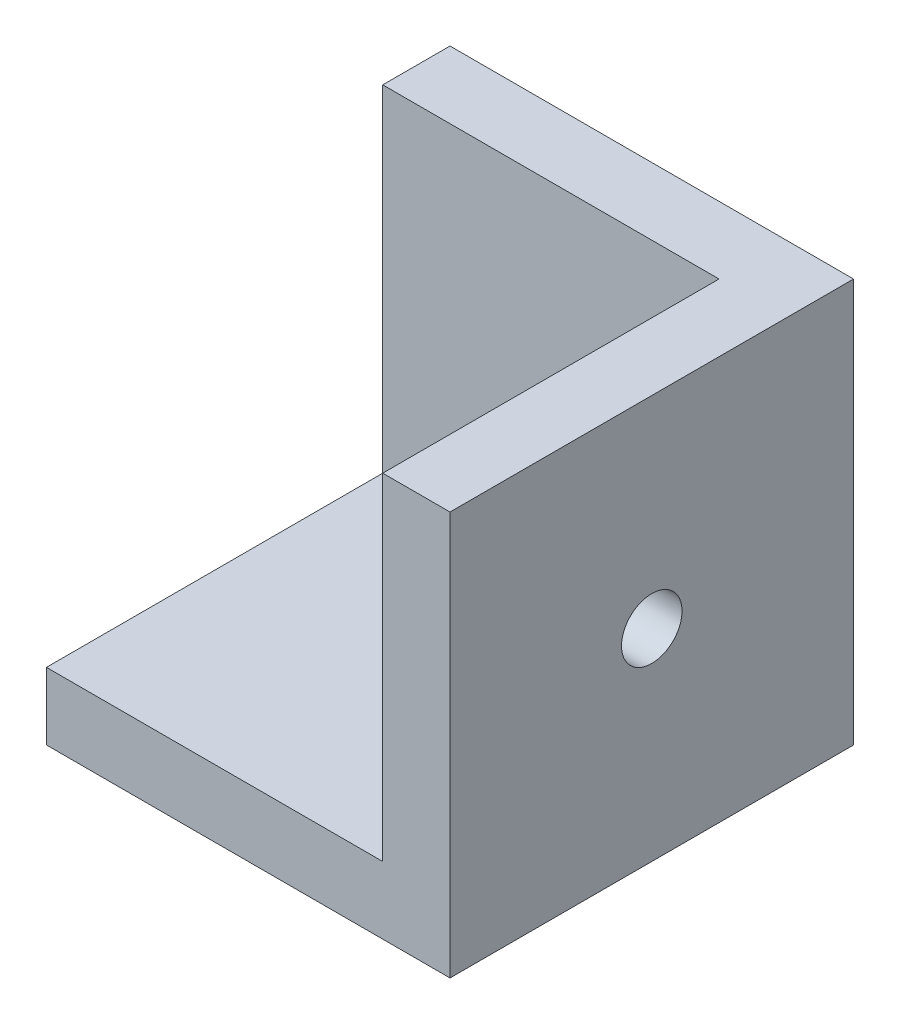
ISO-10303-21;
HEADER;
FILE_DESCRIPTION(('STEP AP214'),'2;1');
FILE_NAME('part.step','',(''),(''),'','','');
FILE_SCHEMA(('AUTOMOTIVE_DESIGN { 1 0 10303 214 1 1 1 1 }'));
ENDSEC;
DATA;
#1=APPLICATION_CONTEXT('core data for automotive mechanical design processes');
#2=APPLICATION_PROTOCOL_DEFINITION('international standard','automotive_design',2000,#1);
#3=PRODUCT_CONTEXT('',#1,'mechanical');
#4=PRODUCT('Part','Part','',(#3));
#5=PRODUCT_RELATED_PRODUCT_CATEGORY('part','',(#4));
#6=PRODUCT_DEFINITION_FORMATION('','',#4);
#7=PRODUCT_DEFINITION_CONTEXT('part definition',#1,'design');
#8=PRODUCT_DEFINITION('design','',#6,#7);
#9=PRODUCT_DEFINITION_SHAPE('','',#8);
#10=(LENGTH_UNIT() NAMED_UNIT(*) SI_UNIT(.MILLI.,.METRE.));
#11=(NAMED_UNIT(*) PLANE_ANGLE_UNIT() SI_UNIT($,.RADIAN.));
#12=(NAMED_UNIT(*) SI_UNIT($,.STERADIAN.) SOLID_ANGLE_UNIT());
#13=UNCERTAINTY_MEASURE_WITH_UNIT(LENGTH_MEASURE(1.E-05),#10,'distance_accuracy_value','');
#14=(GEOMETRIC_REPRESENTATION_CONTEXT(3) GLOBAL_UNCERTAINTY_ASSIGNED_CONTEXT((#13)) GLOBAL_UNIT_ASSIGNED_CONTEXT((#10,
#11,#12)) REPRESENTATION_CONTEXT('',''));
#15=CARTESIAN_POINT('',(0.,0.,0.));
#16=DIRECTION('',(0.,0.,1.));
#17=DIRECTION('',(1.,0.,0.));
#18=AXIS2_PLACEMENT_3D('',#15,#16,#17);
#19=CARTESIAN_POINT('',(0.,0.,30.));
#20=DIRECTION('',(-1.,0.,0.));
#21=DIRECTION('',(0.,0.,1.));
#22=AXIS2_PLACEMENT_3D('',#19,#20,#21);
#23=PLANE('',#22);
#24=CARTESIAN_POINT('',(0.,15.,15.));
#25=DIRECTION('',(-1.,0.,0.));
#26=DIRECTION('',(0.,0.,1.));
#27=AXIS2_PLACEMENT_3D('',#24,#25,#26);
#28=CIRCLE('',#27,2.25);
#29=CARTESIAN_POINT('',(0.,15.,17.25));
#30=VERTEX_POINT('',#29);
#31=EDGE_CURVE('E200',#30,#30,#28,.T.);
#32=ORIENTED_EDGE('',*,*,#31,.T.);
#33=EDGE_LOOP('',(#32));
#34=FACE_BOUND('',#33,.T.);
#35=DIRECTION('',(0.,1.,0.));
#36=VECTOR('',#35,1.);
#37=CARTESIAN_POINT('',(0.,0.,0.));
#38=LINE('',#37,#36);
#39=CARTESIAN_POINT('',(0.,0.,0.));
#40=VERTEX_POINT('',#39);
#41=CARTESIAN_POINT('',(0.,30.,0.));
#42=VERTEX_POINT('',#41);
#43=EDGE_CURVE('E148',#40,#42,#38,.T.);
#44=ORIENTED_EDGE('',*,*,#43,.T.);
#45=DIRECTION('',(0.,0.,-1.));
#46=VECTOR('',#45,1.);
#47=CARTESIAN_POINT('',(0.,30.,30.));
#48=LINE('',#47,#46);
#49=CARTESIAN_POINT('',(0.,30.,30.));
#50=VERTEX_POINT('',#49);
#51=EDGE_CURVE('E13',#50,#42,#48,.T.);
#52=ORIENTED_EDGE('',*,*,#51,.F.);
#53=DIRECTION('',(0.,1.,0.));
#54=VECTOR('',#53,1.);
#55=CARTESIAN_POINT('',(0.,0.,30.));
#56=LINE('',#55,#54);
#57=CARTESIAN_POINT('',(0.,0.,30.));
#58=VERTEX_POINT('',#57);
#59=EDGE_CURVE('E150',#58,#50,#56,.T.);
#60=ORIENTED_EDGE('',*,*,#59,.F.);
#61=DIRECTION('',(0.,0.,-1.));
#62=VECTOR('',#61,1.);
#63=CARTESIAN_POINT('',(0.,0.,30.));
#64=LINE('',#63,#62);
#65=EDGE_CURVE('E156',#58,#40,#64,.T.);
#66=ORIENTED_EDGE('',*,*,#65,.T.);
#67=EDGE_LOOP('',(#44,#52,#60,#66));
#68=FACE_BOUND('',#67,.T.);
#69=ADVANCED_FACE('F50',(#34,#68),#23,.F.);
#70=CARTESIAN_POINT('',(0.,30.,30.));
#71=DIRECTION('',(0.,-1.,0.));
#72=DIRECTION('',(1.,0.,0.));
#73=AXIS2_PLACEMENT_3D('',#70,#71,#72);
#74=PLANE('',#73);
#75=DIRECTION('',(-1.,0.,0.));
#76=VECTOR('',#75,1.);
#77=CARTESIAN_POINT('',(-5.,30.,5.));
#78=LINE('',#77,#76);
#79=CARTESIAN_POINT('',(-5.,30.,5.));
#80=VERTEX_POINT('',#79);
#81=CARTESIAN_POINT('',(-30.,30.,5.));
#82=VERTEX_POINT('',#81);
#83=EDGE_CURVE('E136',#80,#82,#78,.T.);
#84=ORIENTED_EDGE('',*,*,#83,.F.);
#85=DIRECTION('',(0.,0.,-1.));
#86=VECTOR('',#85,1.);
#87=CARTESIAN_POINT('',(-5.,30.,5.));
#88=LINE('',#87,#86);
#89=CARTESIAN_POINT('',(-5.,30.,30.));
#90=VERTEX_POINT('',#89);
#91=EDGE_CURVE('E124',#90,#80,#88,.T.);
#92=ORIENTED_EDGE('',*,*,#91,.F.);
#93=DIRECTION('',(-1.,0.,0.));
#94=VECTOR('',#93,1.);
#95=CARTESIAN_POINT('',(0.,30.,30.));
#96=LINE('',#95,#94);
#97=EDGE_CURVE('E99',#50,#90,#96,.T.);
#98=ORIENTED_EDGE('',*,*,#97,.F.);
#99=ORIENTED_EDGE('',*,*,#51,.T.);
#100=DIRECTION('',(-1.,0.,0.));
#101=VECTOR('',#100,1.);
#102=CARTESIAN_POINT('',(0.,30.,0.));
#103=LINE('',#102,#101);
#104=CARTESIAN_POINT('',(-30.,30.,0.));
#105=VERTEX_POINT('',#104);
#106=EDGE_CURVE('E159',#42,#105,#103,.T.);
#107=ORIENTED_EDGE('',*,*,#106,.T.);
#108=DIRECTION('',(0.,0.,-1.));
#109=VECTOR('',#108,1.);
#110=CARTESIAN_POINT('',(-30.,30.,30.));
#111=LINE('',#110,#109);
#112=EDGE_CURVE('E57',#82,#105,#111,.T.);
#113=ORIENTED_EDGE('',*,*,#112,.F.);
#114=EDGE_LOOP('',(#84,#92,#98,#99,#107,#113));
#115=FACE_BOUND('',#114,.T.);
#116=ADVANCED_FACE('F172',(#115),#74,.F.);
#117=CARTESIAN_POINT('',(-30.,0.,30.));
#118=DIRECTION('',(1.,0.,0.));
#119=DIRECTION('',(0.,0.,-1.));
#120=AXIS2_PLACEMENT_3D('',#117,#118,#119);
#121=PLANE('',#120);
#122=DIRECTION('',(0.,0.,1.));
#123=VECTOR('',#122,1.);
#124=CARTESIAN_POINT('',(-30.,5.,5.));
#125=LINE('',#124,#123);
#126=CARTESIAN_POINT('',(-30.,5.,5.));
#127=VERTEX_POINT('',#126);
#128=CARTESIAN_POINT('',(-30.,5.,30.));
#129=VERTEX_POINT('',#128);
#130=EDGE_CURVE('E64',#127,#129,#125,.T.);
#131=ORIENTED_EDGE('',*,*,#130,.F.);
#132=DIRECTION('',(0.,1.,0.));
#133=VECTOR('',#132,1.);
#134=CARTESIAN_POINT('',(-30.,5.,5.));
#135=LINE('',#134,#133);
#136=EDGE_CURVE('E127',#127,#82,#135,.T.);
#137=ORIENTED_EDGE('',*,*,#136,.T.);
#138=ORIENTED_EDGE('',*,*,#112,.T.);
#139=DIRECTION('',(0.,-1.,0.));
#140=VECTOR('',#139,1.);
#141=CARTESIAN_POINT('',(-30.,0.,0.));
#142=LINE('',#141,#140);
#143=CARTESIAN_POINT('',(-30.,0.,0.));
#144=VERTEX_POINT('',#143);
#145=EDGE_CURVE('E162',#105,#144,#142,.T.);
#146=ORIENTED_EDGE('',*,*,#145,.T.);
#147=DIRECTION('',(0.,0.,-1.));
#148=VECTOR('',#147,1.);
#149=CARTESIAN_POINT('',(-30.,0.,30.));
#150=LINE('',#149,#148);
#151=CARTESIAN_POINT('',(-30.,0.,30.));
#152=VERTEX_POINT('',#151);
#153=EDGE_CURVE('E166',#152,#144,#150,.T.);
#154=ORIENTED_EDGE('',*,*,#153,.F.);
#155=DIRECTION('',(0.,-1.,0.));
#156=VECTOR('',#155,1.);
#157=CARTESIAN_POINT('',(-30.,0.,30.));
#158=LINE('',#157,#156);
#159=EDGE_CURVE('E153',#129,#152,#158,.T.);
#160=ORIENTED_EDGE('',*,*,#159,.F.);
#161=EDGE_LOOP('',(#131,#137,#138,#146,#154,#160));
#162=FACE_BOUND('',#161,.T.);
#163=ADVANCED_FACE('F169',(#162),#121,.F.);
#164=CARTESIAN_POINT('',(0.,0.,30.));
#165=DIRECTION('',(0.,1.,0.));
#166=DIRECTION('',(-1.,0.,0.));
#167=AXIS2_PLACEMENT_3D('',#164,#165,#166);
#168=PLANE('',#167);
#169=CARTESIAN_POINT('',(-15.,0.,15.));
#170=DIRECTION('',(0.,1.,0.));
#171=DIRECTION('',(0.,0.,1.));
#172=AXIS2_PLACEMENT_3D('',#169,#170,#171);
#173=CIRCLE('',#172,2.25);
#174=CARTESIAN_POINT('',(-15.,0.,17.25));
#175=VERTEX_POINT('',#174);
#176=EDGE_CURVE('E140',#175,#175,#173,.T.);
#177=ORIENTED_EDGE('',*,*,#176,.T.);
#178=EDGE_LOOP('',(#177));
#179=FACE_BOUND('',#178,.T.);
#180=DIRECTION('',(1.,0.,0.));
#181=VECTOR('',#180,1.);
#182=CARTESIAN_POINT('',(0.,0.,0.));
#183=LINE('',#182,#181);
#184=EDGE_CURVE('E93',#144,#40,#183,.T.);
#185=ORIENTED_EDGE('',*,*,#184,.T.);
#186=ORIENTED_EDGE('',*,*,#65,.F.);
#187=DIRECTION('',(1.,0.,0.));
#188=VECTOR('',#187,1.);
#189=CARTESIAN_POINT('',(0.,0.,30.));
#190=LINE('',#189,#188);
#191=EDGE_CURVE('E73',#152,#58,#190,.T.);
#192=ORIENTED_EDGE('',*,*,#191,.F.);
#193=ORIENTED_EDGE('',*,*,#153,.T.);
#194=EDGE_LOOP('',(#185,#186,#192,#193));
#195=FACE_BOUND('',#194,.T.);
#196=ADVANCED_FACE('F179',(#179,#195),#168,.F.);
#197=CARTESIAN_POINT('',(0.,0.,30.));
#198=DIRECTION('',(0.,0.,1.));
#199=DIRECTION('',(1.,0.,0.));
#200=AXIS2_PLACEMENT_3D('',#197,#198,#199);
#201=PLANE('',#200);
#202=DIRECTION('',(0.,1.,0.));
#203=VECTOR('',#202,1.);
#204=CARTESIAN_POINT('',(-5.,5.,30.));
#205=LINE('',#204,#203);
#206=CARTESIAN_POINT('',(-5.,5.,30.));
#207=VERTEX_POINT('',#206);
#208=EDGE_CURVE('E146',#207,#90,#205,.T.);
#209=ORIENTED_EDGE('',*,*,#208,.F.);
#210=DIRECTION('',(1.,0.,0.));
#211=VECTOR('',#210,1.);
#212=CARTESIAN_POINT('',(-5.,5.,30.));
#213=LINE('',#212,#211);
#214=EDGE_CURVE('E128',#129,#207,#213,.T.);
#215=ORIENTED_EDGE('',*,*,#214,.F.);
#216=ORIENTED_EDGE('',*,*,#159,.T.);
#217=ORIENTED_EDGE('',*,*,#191,.T.);
#218=ORIENTED_EDGE('',*,*,#59,.T.);
#219=ORIENTED_EDGE('',*,*,#97,.T.);
#220=EDGE_LOOP('',(#209,#215,#216,#217,#218,#219));
#221=FACE_BOUND('',#220,.T.);
#222=ADVANCED_FACE('F181',(#221),#201,.T.);
#223=CARTESIAN_POINT('',(0.,0.,0.));
#224=DIRECTION('',(0.,0.,1.));
#225=DIRECTION('',(1.,0.,0.));
#226=AXIS2_PLACEMENT_3D('',#223,#224,#225);
#227=PLANE('',#226);
#228=CARTESIAN_POINT('',(-15.,15.,0.));
#229=DIRECTION('',(0.,0.,1.));
#230=DIRECTION('',(1.,0.,0.));
#231=AXIS2_PLACEMENT_3D('',#228,#229,#230);
#232=CIRCLE('',#231,2.25);
#233=CARTESIAN_POINT('',(-12.75,15.,0.));
#234=VERTEX_POINT('',#233);
#235=EDGE_CURVE('E206',#234,#234,#232,.T.);
#236=ORIENTED_EDGE('',*,*,#235,.T.);
#237=EDGE_LOOP('',(#236));
#238=FACE_BOUND('',#237,.T.);
#239=ORIENTED_EDGE('',*,*,#43,.F.);
#240=ORIENTED_EDGE('',*,*,#184,.F.);
#241=ORIENTED_EDGE('',*,*,#145,.F.);
#242=ORIENTED_EDGE('',*,*,#106,.F.);
#243=EDGE_LOOP('',(#239,#240,#241,#242));
#244=FACE_BOUND('',#243,.T.);
#245=ADVANCED_FACE('F176',(#238,#244),#227,.F.);
#246=CARTESIAN_POINT('',(-5.,5.,5.));
#247=DIRECTION('',(1.,0.,0.));
#248=DIRECTION('',(0.,0.,-1.));
#249=AXIS2_PLACEMENT_3D('',#246,#247,#248);
#250=PLANE('',#249);
#251=CARTESIAN_POINT('',(-5.,15.,15.));
#252=DIRECTION('',(-1.,0.,0.));
#253=DIRECTION('',(0.,0.,1.));
#254=AXIS2_PLACEMENT_3D('',#251,#252,#253);
#255=CIRCLE('',#254,2.25);
#256=CARTESIAN_POINT('',(-5.,15.,17.25));
#257=VERTEX_POINT('',#256);
#258=EDGE_CURVE('E203',#257,#257,#255,.T.);
#259=ORIENTED_EDGE('',*,*,#258,.F.);
#260=EDGE_LOOP('',(#259));
#261=FACE_BOUND('',#260,.T.);
#262=ORIENTED_EDGE('',*,*,#91,.T.);
#263=DIRECTION('',(0.,1.,0.));
#264=VECTOR('',#263,1.);
#265=CARTESIAN_POINT('',(-5.,5.,5.));
#266=LINE('',#265,#264);
#267=CARTESIAN_POINT('',(-5.,5.,5.));
#268=VERTEX_POINT('',#267);
#269=EDGE_CURVE('E119',#268,#80,#266,.T.);
#270=ORIENTED_EDGE('',*,*,#269,.F.);
#271=DIRECTION('',(0.,0.,-1.));
#272=VECTOR('',#271,1.);
#273=CARTESIAN_POINT('',(-5.,5.,5.));
#274=LINE('',#273,#272);
#275=EDGE_CURVE('E123',#207,#268,#274,.T.);
#276=ORIENTED_EDGE('',*,*,#275,.F.);
#277=ORIENTED_EDGE('',*,*,#208,.T.);
#278=EDGE_LOOP('',(#262,#270,#276,#277));
#279=FACE_BOUND('',#278,.T.);
#280=ADVANCED_FACE('F121',(#261,#279),#250,.F.);
#281=CARTESIAN_POINT('',(-5.,5.,5.));
#282=DIRECTION('',(0.,0.,-1.));
#283=DIRECTION('',(-1.,0.,0.));
#284=AXIS2_PLACEMENT_3D('',#281,#282,#283);
#285=PLANE('',#284);
#286=CARTESIAN_POINT('',(-15.,15.,5.));
#287=DIRECTION('',(0.,0.,1.));
#288=DIRECTION('',(1.,0.,0.));
#289=AXIS2_PLACEMENT_3D('',#286,#287,#288);
#290=CIRCLE('',#289,2.25);
#291=CARTESIAN_POINT('',(-12.75,15.,5.));
#292=VERTEX_POINT('',#291);
#293=EDGE_CURVE('E202',#292,#292,#290,.T.);
#294=ORIENTED_EDGE('',*,*,#293,.F.);
#295=EDGE_LOOP('',(#294));
#296=FACE_BOUND('',#295,.T.);
#297=ORIENTED_EDGE('',*,*,#83,.T.);
#298=ORIENTED_EDGE('',*,*,#136,.F.);
#299=DIRECTION('',(-1.,0.,0.));
#300=VECTOR('',#299,1.);
#301=CARTESIAN_POINT('',(-5.,5.,5.));
#302=LINE('',#301,#300);
#303=EDGE_CURVE('E130',#268,#127,#302,.T.);
#304=ORIENTED_EDGE('',*,*,#303,.F.);
#305=ORIENTED_EDGE('',*,*,#269,.T.);
#306=EDGE_LOOP('',(#297,#298,#304,#305));
#307=FACE_BOUND('',#306,.T.);
#308=ADVANCED_FACE('F131',(#296,#307),#285,.F.);
#309=CARTESIAN_POINT('',(0.,5.,0.));
#310=DIRECTION('',(0.,-1.,0.));
#311=DIRECTION('',(0.,0.,-1.));
#312=AXIS2_PLACEMENT_3D('',#309,#310,#311);
#313=PLANE('',#312);
#314=CARTESIAN_POINT('',(-15.,5.,15.));
#315=DIRECTION('',(0.,1.,0.));
#316=DIRECTION('',(0.,0.,1.));
#317=AXIS2_PLACEMENT_3D('',#314,#315,#316);
#318=CIRCLE('',#317,2.25);
#319=CARTESIAN_POINT('',(-15.,5.,17.25));
#320=VERTEX_POINT('',#319);
#321=EDGE_CURVE('E212',#320,#320,#318,.T.);
#322=ORIENTED_EDGE('',*,*,#321,.F.);
#323=EDGE_LOOP('',(#322));
#324=FACE_BOUND('',#323,.T.);
#325=ORIENTED_EDGE('',*,*,#275,.T.);
#326=ORIENTED_EDGE('',*,*,#303,.T.);
#327=ORIENTED_EDGE('',*,*,#130,.T.);
#328=ORIENTED_EDGE('',*,*,#214,.T.);
#329=EDGE_LOOP('',(#325,#326,#327,#328));
#330=FACE_BOUND('',#329,.T.);
#331=ADVANCED_FACE('F134',(#324,#330),#313,.F.);
#332=CARTESIAN_POINT('',(-15.,5.,15.));
#333=DIRECTION('',(0.,1.,0.));
#334=DIRECTION('',(0.,0.,1.));
#335=AXIS2_PLACEMENT_3D('',#332,#333,#334);
#336=CYLINDRICAL_SURFACE('',#335,2.25);
#337=ORIENTED_EDGE('',*,*,#176,.F.);
#338=EDGE_LOOP('',(#337));
#339=FACE_BOUND('',#338,.T.);
#340=ORIENTED_EDGE('',*,*,#321,.T.);
#341=EDGE_LOOP('',(#340));
#342=FACE_BOUND('',#341,.T.);
#343=ADVANCED_FACE('F219',(#339,#342),#336,.F.);
#344=CARTESIAN_POINT('',(-15.,15.,5.));
#345=DIRECTION('',(0.,0.,1.));
#346=DIRECTION('',(1.,0.,0.));
#347=AXIS2_PLACEMENT_3D('',#344,#345,#346);
#348=CYLINDRICAL_SURFACE('',#347,2.25);
#349=ORIENTED_EDGE('',*,*,#235,.F.);
#350=EDGE_LOOP('',(#349));
#351=FACE_BOUND('',#350,.T.);
#352=ORIENTED_EDGE('',*,*,#293,.T.);
#353=EDGE_LOOP('',(#352));
#354=FACE_BOUND('',#353,.T.);
#355=ADVANCED_FACE('F221',(#351,#354),#348,.F.);
#356=CARTESIAN_POINT('',(-5.,15.,15.));
#357=DIRECTION('',(-1.,0.,0.));
#358=DIRECTION('',(0.,0.,1.));
#359=AXIS2_PLACEMENT_3D('',#356,#357,#358);
#360=CYLINDRICAL_SURFACE('',#359,2.25);
#361=ORIENTED_EDGE('',*,*,#31,.F.);
#362=EDGE_LOOP('',(#361));
#363=FACE_BOUND('',#362,.T.);
#364=ORIENTED_EDGE('',*,*,#258,.T.);
#365=EDGE_LOOP('',(#364));
#366=FACE_BOUND('',#365,.T.);
#367=ADVANCED_FACE('F227',(#363,#366),#360,.F.);
#368=CLOSED_SHELL('',(#69,#116,#163,#196,#222,#245,#280,#308,#331,#343,#355,#367));
#369=MANIFOLD_SOLID_BREP('B2',#368);
#370=ADVANCED_BREP_SHAPE_REPRESENTATION('',(#18,#369),#14);
#371=SHAPE_DEFINITION_REPRESENTATION(#9,#370);
ENDSEC;
END-ISO-10303-21;
